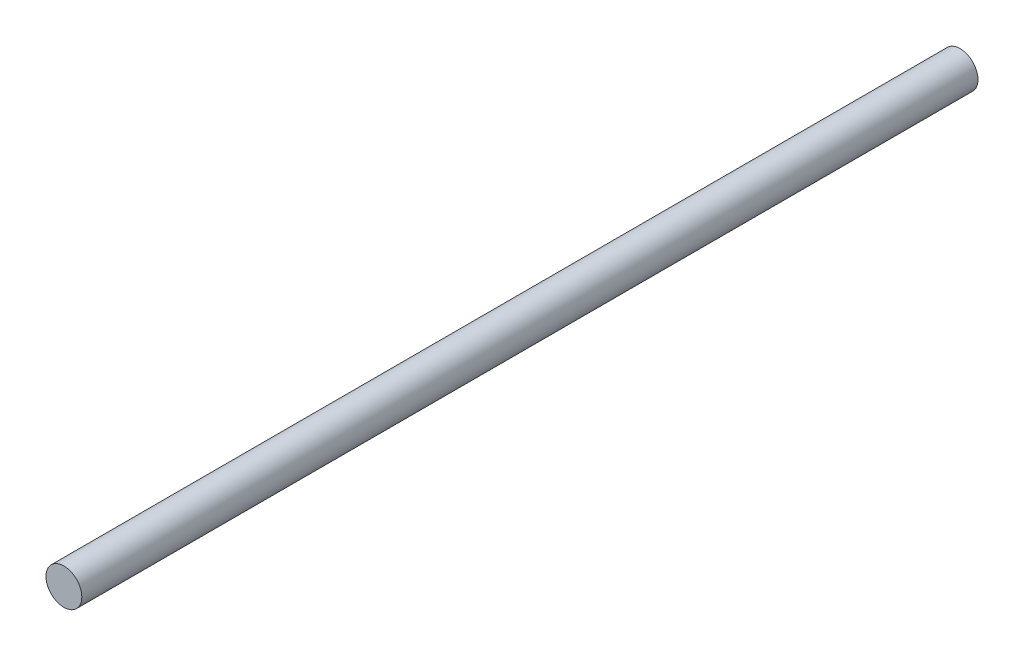
ISO-10303-21;
HEADER;
FILE_DESCRIPTION(('STEP AP214'),'2;1');
FILE_NAME('part.step','',(''),(''),'','','');
FILE_SCHEMA(('AUTOMOTIVE_DESIGN { 1 0 10303 214 1 1 1 1 }'));
ENDSEC;
DATA;
#1=APPLICATION_CONTEXT('core data for automotive mechanical design processes');
#2=APPLICATION_PROTOCOL_DEFINITION('international standard','automotive_design',2000,#1);
#3=PRODUCT_CONTEXT('',#1,'mechanical');
#4=PRODUCT('Part','Part','',(#3));
#5=PRODUCT_RELATED_PRODUCT_CATEGORY('part','',(#4));
#6=PRODUCT_DEFINITION_FORMATION('','',#4);
#7=PRODUCT_DEFINITION_CONTEXT('part definition',#1,'design');
#8=PRODUCT_DEFINITION('design','',#6,#7);
#9=PRODUCT_DEFINITION_SHAPE('','',#8);
#10=(LENGTH_UNIT() NAMED_UNIT(*) SI_UNIT(.MILLI.,.METRE.));
#11=(NAMED_UNIT(*) PLANE_ANGLE_UNIT() SI_UNIT($,.RADIAN.));
#12=(NAMED_UNIT(*) SI_UNIT($,.STERADIAN.) SOLID_ANGLE_UNIT());
#13=UNCERTAINTY_MEASURE_WITH_UNIT(LENGTH_MEASURE(1.E-05),#10,'distance_accuracy_value','');
#14=(GEOMETRIC_REPRESENTATION_CONTEXT(3) GLOBAL_UNCERTAINTY_ASSIGNED_CONTEXT((#13)) GLOBAL_UNIT_ASSIGNED_CONTEXT((#10,
#11,#12)) REPRESENTATION_CONTEXT('',''));
#15=CARTESIAN_POINT('',(0.,0.,0.));
#16=DIRECTION('',(0.,0.,1.));
#17=DIRECTION('',(1.,0.,0.));
#18=AXIS2_PLACEMENT_3D('',#15,#16,#17);
#19=CARTESIAN_POINT('',(0.,0.,200.));
#20=DIRECTION('',(0.,0.,-1.));
#21=DIRECTION('',(-1.,0.,0.));
#22=AXIS2_PLACEMENT_3D('',#19,#20,#21);
#23=CYLINDRICAL_SURFACE('',#22,4.);
#24=CARTESIAN_POINT('',(0.,0.,200.));
#25=DIRECTION('',(0.,0.,1.));
#26=DIRECTION('',(1.,0.,0.));
#27=AXIS2_PLACEMENT_3D('',#24,#25,#26);
#28=CIRCLE('',#27,4.);
#29=CARTESIAN_POINT('',(4.,0.,200.));
#30=VERTEX_POINT('',#29);
#31=EDGE_CURVE('E10',#30,#30,#28,.T.);
#32=ORIENTED_EDGE('',*,*,#31,.F.);
#33=EDGE_LOOP('',(#32));
#34=FACE_BOUND('',#33,.T.);
#35=CARTESIAN_POINT('',(0.,0.,0.));
#36=DIRECTION('',(0.,0.,1.));
#37=DIRECTION('',(1.,0.,0.));
#38=AXIS2_PLACEMENT_3D('',#35,#36,#37);
#39=CIRCLE('',#38,4.);
#40=CARTESIAN_POINT('',(4.,0.,0.));
#41=VERTEX_POINT('',#40);
#42=EDGE_CURVE('E34',#41,#41,#39,.T.);
#43=ORIENTED_EDGE('',*,*,#42,.T.);
#44=EDGE_LOOP('',(#43));
#45=FACE_BOUND('',#44,.T.);
#46=ADVANCED_FACE('F31',(#34,#45),#23,.T.);
#47=CARTESIAN_POINT('',(0.,0.,200.));
#48=DIRECTION('',(0.,0.,1.));
#49=DIRECTION('',(1.,0.,0.));
#50=AXIS2_PLACEMENT_3D('',#47,#48,#49);
#51=PLANE('',#50);
#52=ORIENTED_EDGE('',*,*,#31,.T.);
#53=EDGE_LOOP('',(#52));
#54=FACE_BOUND('',#53,.T.);
#55=ADVANCED_FACE('F46',(#54),#51,.T.);
#56=CARTESIAN_POINT('',(0.,0.,0.));
#57=DIRECTION('',(0.,0.,1.));
#58=DIRECTION('',(1.,0.,0.));
#59=AXIS2_PLACEMENT_3D('',#56,#57,#58);
#60=PLANE('',#59);
#61=ORIENTED_EDGE('',*,*,#42,.F.);
#62=EDGE_LOOP('',(#61));
#63=FACE_BOUND('',#62,.T.);
#64=ADVANCED_FACE('F44',(#63),#60,.F.);
#65=CLOSED_SHELL('',(#46,#55,#64));
#66=MANIFOLD_SOLID_BREP('B2',#65);
#67=ADVANCED_BREP_SHAPE_REPRESENTATION('',(#18,#66),#14);
#68=SHAPE_DEFINITION_REPRESENTATION(#9,#67);
ENDSEC;
END-ISO-10303-21;
